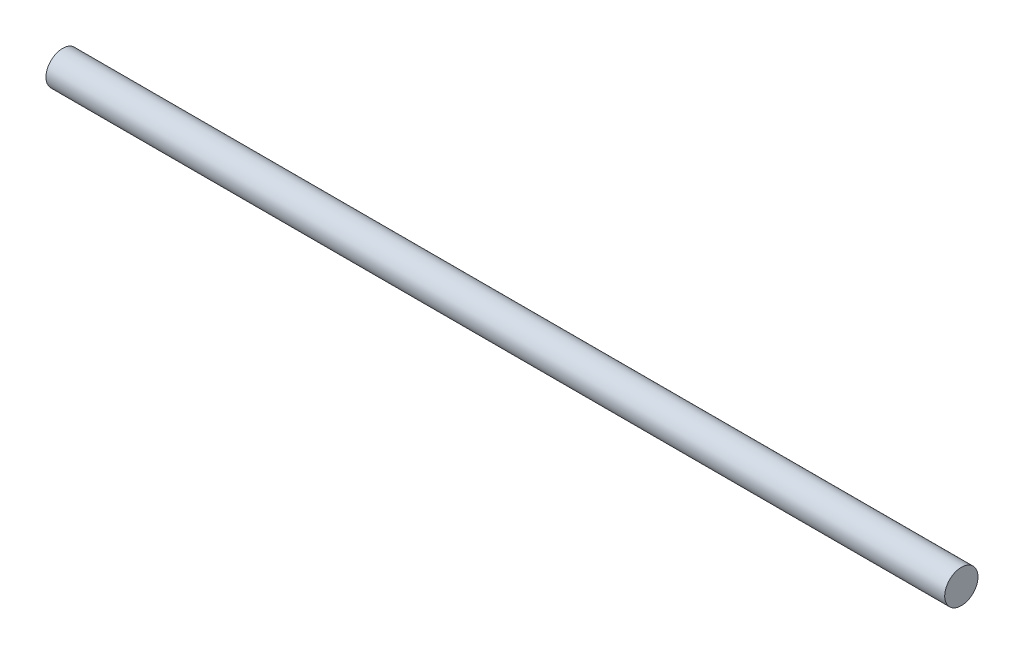
ISO-10303-21;
HEADER;
FILE_DESCRIPTION(('STEP AP214'),'2;1');
FILE_NAME('part.step','',(''),(''),'','','');
FILE_SCHEMA(('AUTOMOTIVE_DESIGN { 1 0 10303 214 1 1 1 1 }'));
ENDSEC;
DATA;
#1=APPLICATION_CONTEXT('core data for automotive mechanical design processes');
#2=APPLICATION_PROTOCOL_DEFINITION('international standard','automotive_design',2000,#1);
#3=PRODUCT_CONTEXT('',#1,'mechanical');
#4=PRODUCT('Part','Part','',(#3));
#5=PRODUCT_RELATED_PRODUCT_CATEGORY('part','',(#4));
#6=PRODUCT_DEFINITION_FORMATION('','',#4);
#7=PRODUCT_DEFINITION_CONTEXT('part definition',#1,'design');
#8=PRODUCT_DEFINITION('design','',#6,#7);
#9=PRODUCT_DEFINITION_SHAPE('','',#8);
#10=(LENGTH_UNIT() NAMED_UNIT(*) SI_UNIT(.MILLI.,.METRE.));
#11=(NAMED_UNIT(*) PLANE_ANGLE_UNIT() SI_UNIT($,.RADIAN.));
#12=(NAMED_UNIT(*) SI_UNIT($,.STERADIAN.) SOLID_ANGLE_UNIT());
#13=UNCERTAINTY_MEASURE_WITH_UNIT(LENGTH_MEASURE(1.E-05),#10,'distance_accuracy_value','');
#14=(GEOMETRIC_REPRESENTATION_CONTEXT(3) GLOBAL_UNCERTAINTY_ASSIGNED_CONTEXT((#13)) GLOBAL_UNIT_ASSIGNED_CONTEXT((#10,
#11,#12)) REPRESENTATION_CONTEXT('',''));
#15=CARTESIAN_POINT('',(0.,0.,0.));
#16=DIRECTION('',(0.,0.,1.));
#17=DIRECTION('',(1.,0.,0.));
#18=AXIS2_PLACEMENT_3D('',#15,#16,#17);
#19=CARTESIAN_POINT('',(171.45,0.,0.));
#20=DIRECTION('',(-1.,0.,0.));
#21=DIRECTION('',(0.,0.,1.));
#22=AXIS2_PLACEMENT_3D('',#19,#20,#21);
#23=CYLINDRICAL_SURFACE('',#22,6.35);
#24=CARTESIAN_POINT('',(171.45,0.,0.));
#25=DIRECTION('',(1.,0.,0.));
#26=DIRECTION('',(0.,0.,-1.));
#27=AXIS2_PLACEMENT_3D('',#24,#25,#26);
#28=CIRCLE('',#27,6.35);
#29=CARTESIAN_POINT('',(171.45,0.,-6.35));
#30=VERTEX_POINT('',#29);
#31=EDGE_CURVE('E10',#30,#30,#28,.T.);
#32=ORIENTED_EDGE('',*,*,#31,.F.);
#33=EDGE_LOOP('',(#32));
#34=FACE_BOUND('',#33,.T.);
#35=CARTESIAN_POINT('',(-171.45,0.,0.));
#36=DIRECTION('',(1.,0.,0.));
#37=DIRECTION('',(0.,0.,-1.));
#38=AXIS2_PLACEMENT_3D('',#35,#36,#37);
#39=CIRCLE('',#38,6.35);
#40=CARTESIAN_POINT('',(-171.45,0.,-6.35));
#41=VERTEX_POINT('',#40);
#42=EDGE_CURVE('E34',#41,#41,#39,.T.);
#43=ORIENTED_EDGE('',*,*,#42,.T.);
#44=EDGE_LOOP('',(#43));
#45=FACE_BOUND('',#44,.T.);
#46=ADVANCED_FACE('F31',(#34,#45),#23,.T.);
#47=CARTESIAN_POINT('',(171.45,0.,0.));
#48=DIRECTION('',(1.,0.,0.));
#49=DIRECTION('',(0.,0.,-1.));
#50=AXIS2_PLACEMENT_3D('',#47,#48,#49);
#51=PLANE('',#50);
#52=ORIENTED_EDGE('',*,*,#31,.T.);
#53=EDGE_LOOP('',(#52));
#54=FACE_BOUND('',#53,.T.);
#55=ADVANCED_FACE('F46',(#54),#51,.T.);
#56=CARTESIAN_POINT('',(-171.45,0.,0.));
#57=DIRECTION('',(1.,0.,0.));
#58=DIRECTION('',(0.,0.,-1.));
#59=AXIS2_PLACEMENT_3D('',#56,#57,#58);
#60=PLANE('',#59);
#61=ORIENTED_EDGE('',*,*,#42,.F.);
#62=EDGE_LOOP('',(#61));
#63=FACE_BOUND('',#62,.T.);
#64=ADVANCED_FACE('F44',(#63),#60,.F.);
#65=CLOSED_SHELL('',(#46,#55,#64));
#66=MANIFOLD_SOLID_BREP('B2',#65);
#67=ADVANCED_BREP_SHAPE_REPRESENTATION('',(#18,#66),#14);
#68=SHAPE_DEFINITION_REPRESENTATION(#9,#67);
ENDSEC;
END-ISO-10303-21;
